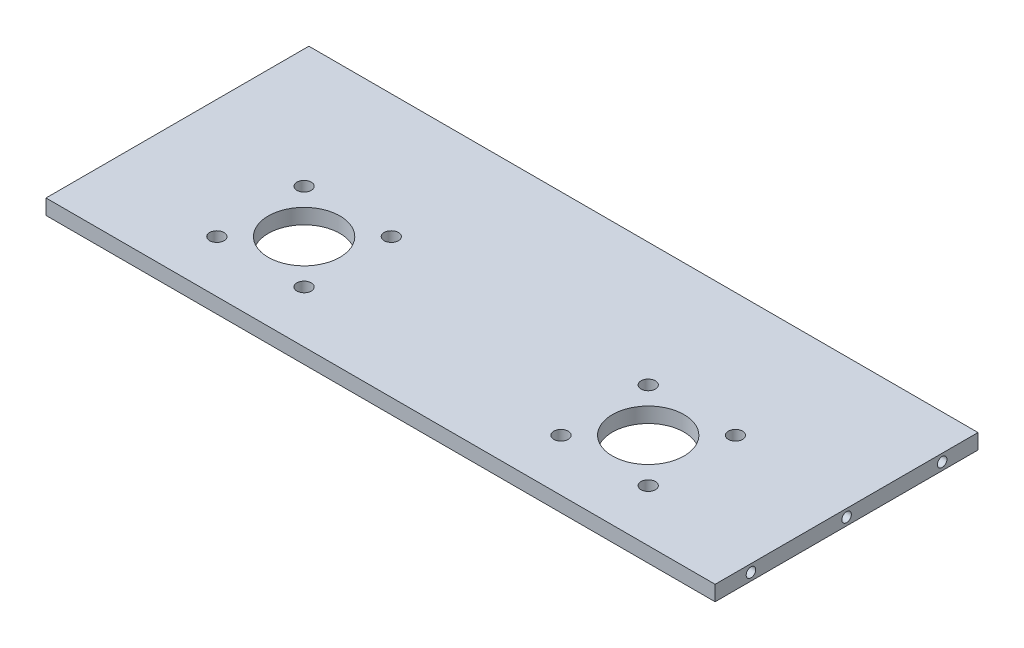
ISO-10303-21;
HEADER;
FILE_DESCRIPTION(('STEP AP214'),'2;1');
FILE_NAME('part.step','',(''),(''),'','','');
FILE_SCHEMA(('AUTOMOTIVE_DESIGN { 1 0 10303 214 1 1 1 1 }'));
ENDSEC;
DATA;
#1=APPLICATION_CONTEXT('core data for automotive mechanical design processes');
#2=APPLICATION_PROTOCOL_DEFINITION('international standard','automotive_design',2000,#1);
#3=PRODUCT_CONTEXT('',#1,'mechanical');
#4=PRODUCT('Part','Part','',(#3));
#5=PRODUCT_RELATED_PRODUCT_CATEGORY('part','',(#4));
#6=PRODUCT_DEFINITION_FORMATION('','',#4);
#7=PRODUCT_DEFINITION_CONTEXT('part definition',#1,'design');
#8=PRODUCT_DEFINITION('design','',#6,#7);
#9=PRODUCT_DEFINITION_SHAPE('','',#8);
#10=(LENGTH_UNIT() NAMED_UNIT(*) SI_UNIT(.MILLI.,.METRE.));
#11=(NAMED_UNIT(*) PLANE_ANGLE_UNIT() SI_UNIT($,.RADIAN.));
#12=(NAMED_UNIT(*) SI_UNIT($,.STERADIAN.) SOLID_ANGLE_UNIT());
#13=UNCERTAINTY_MEASURE_WITH_UNIT(LENGTH_MEASURE(1.E-05),#10,'distance_accuracy_value','');
#14=(GEOMETRIC_REPRESENTATION_CONTEXT(3) GLOBAL_UNCERTAINTY_ASSIGNED_CONTEXT((#13)) GLOBAL_UNIT_ASSIGNED_CONTEXT((#10,
#11,#12)) REPRESENTATION_CONTEXT('',''));
#15=CARTESIAN_POINT('',(0.,0.,0.));
#16=DIRECTION('',(0.,0.,1.));
#17=DIRECTION('',(1.,0.,0.));
#18=AXIS2_PLACEMENT_3D('',#15,#16,#17);
#19=CARTESIAN_POINT('',(0.,6.35,0.));
#20=DIRECTION('',(0.,1.,0.));
#21=DIRECTION('',(0.,0.,1.));
#22=AXIS2_PLACEMENT_3D('',#19,#20,#21);
#23=PLANE('',#22);
#24=CARTESIAN_POINT('',(104.544294294294,6.35,31.4932432432432));
#25=DIRECTION('',(0.,1.,0.));
#26=DIRECTION('',(0.,0.,1.));
#27=AXIS2_PLACEMENT_3D('',#24,#25,#26);
#28=CIRCLE('',#27,3.00000000000001);
#29=CARTESIAN_POINT('',(104.544294294294,6.35,34.4932432432432));
#30=VERTEX_POINT('',#29);
#31=EDGE_CURVE('E159',#30,#30,#28,.F.);
#32=ORIENTED_EDGE('',*,*,#31,.T.);
#33=EDGE_LOOP('',(#32));
#34=FACE_BOUND('',#33,.T.);
#35=CARTESIAN_POINT('',(104.544294294294,6.35,-5.00675675675668));
#36=DIRECTION('',(0.,1.,0.));
#37=DIRECTION('',(0.,0.,1.));
#38=AXIS2_PLACEMENT_3D('',#35,#36,#37);
#39=CIRCLE('',#38,3.00000000000001);
#40=CARTESIAN_POINT('',(104.544294294294,6.35,-2.00675675675668));
#41=VERTEX_POINT('',#40);
#42=EDGE_CURVE('E147',#41,#41,#39,.F.);
#43=ORIENTED_EDGE('',*,*,#42,.T.);
#44=EDGE_LOOP('',(#43));
#45=FACE_BOUND('',#44,.T.);
#46=CARTESIAN_POINT('',(-39.4557057057057,6.35,31.4932432432433));
#47=DIRECTION('',(0.,1.,0.));
#48=DIRECTION('',(0.,0.,1.));
#49=AXIS2_PLACEMENT_3D('',#46,#47,#48);
#50=CIRCLE('',#49,3.00000000000001);
#51=CARTESIAN_POINT('',(-39.4557057057057,6.35,34.4932432432433));
#52=VERTEX_POINT('',#51);
#53=EDGE_CURVE('E135',#52,#52,#50,.F.);
#54=ORIENTED_EDGE('',*,*,#53,.T.);
#55=EDGE_LOOP('',(#54));
#56=FACE_BOUND('',#55,.T.);
#57=CARTESIAN_POINT('',(86.2942942942943,6.35,13.2432432432432));
#58=DIRECTION('',(0.,1.,0.));
#59=DIRECTION('',(0.,0.,1.));
#60=AXIS2_PLACEMENT_3D('',#57,#58,#59);
#61=CIRCLE('',#60,15.);
#62=CARTESIAN_POINT('',(86.2942942942943,6.35,28.2432432432432));
#63=VERTEX_POINT('',#62);
#64=EDGE_CURVE('E123',#63,#63,#61,.F.);
#65=ORIENTED_EDGE('',*,*,#64,.T.);
#66=EDGE_LOOP('',(#65));
#67=FACE_BOUND('',#66,.T.);
#68=CARTESIAN_POINT('',(-39.4557057057057,6.35,-5.00675675675672));
#69=DIRECTION('',(0.,1.,0.));
#70=DIRECTION('',(0.,0.,1.));
#71=AXIS2_PLACEMENT_3D('',#68,#69,#70);
#72=CIRCLE('',#71,3.00000000000001);
#73=CARTESIAN_POINT('',(-39.4557057057057,6.35,-2.00675675675671));
#74=VERTEX_POINT('',#73);
#75=EDGE_CURVE('E100',#74,#74,#72,.F.);
#76=ORIENTED_EDGE('',*,*,#75,.T.);
#77=EDGE_LOOP('',(#76));
#78=FACE_BOUND('',#77,.T.);
#79=DIRECTION('',(0.,0.,1.));
#80=VECTOR('',#79,1.);
#81=CARTESIAN_POINT('',(-125.705705705706,6.35,-56.7567567567568));
#82=LINE('',#81,#80);
#83=CARTESIAN_POINT('',(-125.705705705706,6.35,-56.7567567567568));
#84=VERTEX_POINT('',#83);
#85=CARTESIAN_POINT('',(-125.705705705706,6.35,53.2432432432432));
#86=VERTEX_POINT('',#85);
#87=EDGE_CURVE('E85',#84,#86,#82,.T.);
#88=ORIENTED_EDGE('',*,*,#87,.T.);
#89=DIRECTION('',(1.,0.,0.));
#90=VECTOR('',#89,1.);
#91=CARTESIAN_POINT('',(-125.705705705706,6.35,53.2432432432432));
#92=LINE('',#91,#90);
#93=CARTESIAN_POINT('',(154.294294294294,6.35,53.2432432432432));
#94=VERTEX_POINT('',#93);
#95=EDGE_CURVE('E80',#86,#94,#92,.T.);
#96=ORIENTED_EDGE('',*,*,#95,.T.);
#97=DIRECTION('',(0.,0.,-1.));
#98=VECTOR('',#97,1.);
#99=CARTESIAN_POINT('',(154.294294294294,6.35,-56.7567567567568));
#100=LINE('',#99,#98);
#101=CARTESIAN_POINT('',(154.294294294294,6.35,-56.7567567567568));
#102=VERTEX_POINT('',#101);
#103=EDGE_CURVE('E83',#94,#102,#100,.T.);
#104=ORIENTED_EDGE('',*,*,#103,.T.);
#105=DIRECTION('',(-1.,0.,0.));
#106=VECTOR('',#105,1.);
#107=CARTESIAN_POINT('',(-125.705705705706,6.35,-56.7567567567568));
#108=LINE('',#107,#106);
#109=EDGE_CURVE('E50',#102,#84,#108,.T.);
#110=ORIENTED_EDGE('',*,*,#109,.T.);
#111=EDGE_LOOP('',(#88,#96,#104,#110));
#112=FACE_BOUND('',#111,.T.);
#113=CARTESIAN_POINT('',(-75.9557057057057,6.35,-5.00675675675672));
#114=DIRECTION('',(0.,1.,0.));
#115=DIRECTION('',(0.,0.,1.));
#116=AXIS2_PLACEMENT_3D('',#113,#114,#115);
#117=CIRCLE('',#116,3.00000000000001);
#118=CARTESIAN_POINT('',(-75.9557057057057,6.35,-2.00675675675671));
#119=VERTEX_POINT('',#118);
#120=EDGE_CURVE('E117',#119,#119,#117,.F.);
#121=ORIENTED_EDGE('',*,*,#120,.T.);
#122=EDGE_LOOP('',(#121));
#123=FACE_BOUND('',#122,.T.);
#124=CARTESIAN_POINT('',(-57.7057057057057,6.35,13.2432432432433));
#125=DIRECTION('',(0.,1.,0.));
#126=DIRECTION('',(0.,0.,1.));
#127=AXIS2_PLACEMENT_3D('',#124,#125,#126);
#128=CIRCLE('',#127,15.);
#129=CARTESIAN_POINT('',(-57.7057057057057,6.35,28.2432432432432));
#130=VERTEX_POINT('',#129);
#131=EDGE_CURVE('E129',#130,#130,#128,.F.);
#132=ORIENTED_EDGE('',*,*,#131,.T.);
#133=EDGE_LOOP('',(#132));
#134=FACE_BOUND('',#133,.T.);
#135=CARTESIAN_POINT('',(-75.9557057057057,6.35,31.4932432432433));
#136=DIRECTION('',(0.,1.,0.));
#137=DIRECTION('',(0.,0.,1.));
#138=AXIS2_PLACEMENT_3D('',#135,#136,#137);
#139=CIRCLE('',#138,3.00000000000001);
#140=CARTESIAN_POINT('',(-75.9557057057057,6.35,34.4932432432433));
#141=VERTEX_POINT('',#140);
#142=EDGE_CURVE('E141',#141,#141,#139,.F.);
#143=ORIENTED_EDGE('',*,*,#142,.T.);
#144=EDGE_LOOP('',(#143));
#145=FACE_BOUND('',#144,.T.);
#146=CARTESIAN_POINT('',(68.0442942942943,6.35,-5.00675675675668));
#147=DIRECTION('',(0.,1.,0.));
#148=DIRECTION('',(0.,0.,1.));
#149=AXIS2_PLACEMENT_3D('',#146,#147,#148);
#150=CIRCLE('',#149,3.00000000000001);
#151=CARTESIAN_POINT('',(68.0442942942943,6.35,-2.00675675675668));
#152=VERTEX_POINT('',#151);
#153=EDGE_CURVE('E153',#152,#152,#150,.F.);
#154=ORIENTED_EDGE('',*,*,#153,.T.);
#155=EDGE_LOOP('',(#154));
#156=FACE_BOUND('',#155,.T.);
#157=CARTESIAN_POINT('',(68.0442942942943,6.35,31.4932432432432));
#158=DIRECTION('',(0.,1.,0.));
#159=DIRECTION('',(0.,0.,1.));
#160=AXIS2_PLACEMENT_3D('',#157,#158,#159);
#161=CIRCLE('',#160,3.00000000000001);
#162=CARTESIAN_POINT('',(68.0442942942943,6.35,34.4932432432432));
#163=VERTEX_POINT('',#162);
#164=EDGE_CURVE('E165',#163,#163,#161,.F.);
#165=ORIENTED_EDGE('',*,*,#164,.T.);
#166=EDGE_LOOP('',(#165));
#167=FACE_BOUND('',#166,.T.);
#168=ADVANCED_FACE('F33',(#34,#45,#56,#67,#78,#112,#123,#134,#145,#156,#167),#23,.T.);
#169=CARTESIAN_POINT('',(0.,0.,0.));
#170=DIRECTION('',(0.,1.,0.));
#171=DIRECTION('',(0.,0.,1.));
#172=AXIS2_PLACEMENT_3D('',#169,#170,#171);
#173=PLANE('',#172);
#174=CARTESIAN_POINT('',(104.544294294294,0.,31.4932432432432));
#175=DIRECTION('',(0.,1.,0.));
#176=DIRECTION('',(0.,0.,1.));
#177=AXIS2_PLACEMENT_3D('',#174,#175,#176);
#178=CIRCLE('',#177,3.00000000000001);
#179=CARTESIAN_POINT('',(104.544294294294,0.,34.4932432432432));
#180=VERTEX_POINT('',#179);
#181=EDGE_CURVE('E162',#180,#180,#178,.T.);
#182=ORIENTED_EDGE('',*,*,#181,.T.);
#183=EDGE_LOOP('',(#182));
#184=FACE_BOUND('',#183,.T.);
#185=CARTESIAN_POINT('',(104.544294294294,0.,-5.00675675675668));
#186=DIRECTION('',(0.,1.,0.));
#187=DIRECTION('',(0.,0.,1.));
#188=AXIS2_PLACEMENT_3D('',#185,#186,#187);
#189=CIRCLE('',#188,3.00000000000001);
#190=CARTESIAN_POINT('',(104.544294294294,0.,-2.00675675675668));
#191=VERTEX_POINT('',#190);
#192=EDGE_CURVE('E150',#191,#191,#189,.T.);
#193=ORIENTED_EDGE('',*,*,#192,.T.);
#194=EDGE_LOOP('',(#193));
#195=FACE_BOUND('',#194,.T.);
#196=CARTESIAN_POINT('',(-39.4557057057057,0.,31.4932432432433));
#197=DIRECTION('',(0.,1.,0.));
#198=DIRECTION('',(0.,0.,1.));
#199=AXIS2_PLACEMENT_3D('',#196,#197,#198);
#200=CIRCLE('',#199,3.00000000000001);
#201=CARTESIAN_POINT('',(-39.4557057057057,0.,34.4932432432433));
#202=VERTEX_POINT('',#201);
#203=EDGE_CURVE('E138',#202,#202,#200,.T.);
#204=ORIENTED_EDGE('',*,*,#203,.T.);
#205=EDGE_LOOP('',(#204));
#206=FACE_BOUND('',#205,.T.);
#207=CARTESIAN_POINT('',(86.2942942942943,0.,13.2432432432432));
#208=DIRECTION('',(0.,1.,0.));
#209=DIRECTION('',(0.,0.,1.));
#210=AXIS2_PLACEMENT_3D('',#207,#208,#209);
#211=CIRCLE('',#210,15.);
#212=CARTESIAN_POINT('',(86.2942942942943,0.,28.2432432432432));
#213=VERTEX_POINT('',#212);
#214=EDGE_CURVE('E126',#213,#213,#211,.T.);
#215=ORIENTED_EDGE('',*,*,#214,.T.);
#216=EDGE_LOOP('',(#215));
#217=FACE_BOUND('',#216,.T.);
#218=CARTESIAN_POINT('',(-39.4557057057057,0.,-5.00675675675672));
#219=DIRECTION('',(0.,1.,0.));
#220=DIRECTION('',(0.,0.,1.));
#221=AXIS2_PLACEMENT_3D('',#218,#219,#220);
#222=CIRCLE('',#221,3.00000000000001);
#223=CARTESIAN_POINT('',(-39.4557057057057,0.,-2.00675675675671));
#224=VERTEX_POINT('',#223);
#225=EDGE_CURVE('E114',#224,#224,#222,.T.);
#226=ORIENTED_EDGE('',*,*,#225,.T.);
#227=EDGE_LOOP('',(#226));
#228=FACE_BOUND('',#227,.T.);
#229=DIRECTION('',(0.,0.,1.));
#230=VECTOR('',#229,1.);
#231=CARTESIAN_POINT('',(-125.705705705706,0.,-56.7567567567568));
#232=LINE('',#231,#230);
#233=CARTESIAN_POINT('',(-125.705705705706,0.,-56.7567567567568));
#234=VERTEX_POINT('',#233);
#235=CARTESIAN_POINT('',(-125.705705705706,0.,53.2432432432432));
#236=VERTEX_POINT('',#235);
#237=EDGE_CURVE('E97',#234,#236,#232,.T.);
#238=ORIENTED_EDGE('',*,*,#237,.F.);
#239=DIRECTION('',(-1.,0.,0.));
#240=VECTOR('',#239,1.);
#241=CARTESIAN_POINT('',(-125.705705705706,0.,-56.7567567567568));
#242=LINE('',#241,#240);
#243=CARTESIAN_POINT('',(154.294294294294,0.,-56.7567567567568));
#244=VERTEX_POINT('',#243);
#245=EDGE_CURVE('E73',#244,#234,#242,.T.);
#246=ORIENTED_EDGE('',*,*,#245,.F.);
#247=DIRECTION('',(0.,0.,-1.));
#248=VECTOR('',#247,1.);
#249=CARTESIAN_POINT('',(154.294294294294,0.,-56.7567567567568));
#250=LINE('',#249,#248);
#251=CARTESIAN_POINT('',(154.294294294294,0.,53.2432432432432));
#252=VERTEX_POINT('',#251);
#253=EDGE_CURVE('E67',#252,#244,#250,.T.);
#254=ORIENTED_EDGE('',*,*,#253,.F.);
#255=DIRECTION('',(1.,0.,0.));
#256=VECTOR('',#255,1.);
#257=CARTESIAN_POINT('',(-125.705705705706,0.,53.2432432432432));
#258=LINE('',#257,#256);
#259=EDGE_CURVE('E89',#236,#252,#258,.T.);
#260=ORIENTED_EDGE('',*,*,#259,.F.);
#261=EDGE_LOOP('',(#238,#246,#254,#260));
#262=FACE_BOUND('',#261,.T.);
#263=CARTESIAN_POINT('',(-75.9557057057057,0.,-5.00675675675672));
#264=DIRECTION('',(0.,1.,0.));
#265=DIRECTION('',(0.,0.,1.));
#266=AXIS2_PLACEMENT_3D('',#263,#264,#265);
#267=CIRCLE('',#266,3.00000000000001);
#268=CARTESIAN_POINT('',(-75.9557057057057,0.,-2.00675675675671));
#269=VERTEX_POINT('',#268);
#270=EDGE_CURVE('E120',#269,#269,#267,.T.);
#271=ORIENTED_EDGE('',*,*,#270,.T.);
#272=EDGE_LOOP('',(#271));
#273=FACE_BOUND('',#272,.T.);
#274=CARTESIAN_POINT('',(-57.7057057057057,0.,13.2432432432433));
#275=DIRECTION('',(0.,1.,0.));
#276=DIRECTION('',(0.,0.,1.));
#277=AXIS2_PLACEMENT_3D('',#274,#275,#276);
#278=CIRCLE('',#277,15.);
#279=CARTESIAN_POINT('',(-57.7057057057057,0.,28.2432432432432));
#280=VERTEX_POINT('',#279);
#281=EDGE_CURVE('E132',#280,#280,#278,.T.);
#282=ORIENTED_EDGE('',*,*,#281,.T.);
#283=EDGE_LOOP('',(#282));
#284=FACE_BOUND('',#283,.T.);
#285=CARTESIAN_POINT('',(-75.9557057057057,0.,31.4932432432433));
#286=DIRECTION('',(0.,1.,0.));
#287=DIRECTION('',(0.,0.,1.));
#288=AXIS2_PLACEMENT_3D('',#285,#286,#287);
#289=CIRCLE('',#288,3.00000000000001);
#290=CARTESIAN_POINT('',(-75.9557057057057,0.,34.4932432432433));
#291=VERTEX_POINT('',#290);
#292=EDGE_CURVE('E144',#291,#291,#289,.T.);
#293=ORIENTED_EDGE('',*,*,#292,.T.);
#294=EDGE_LOOP('',(#293));
#295=FACE_BOUND('',#294,.T.);
#296=CARTESIAN_POINT('',(68.0442942942943,0.,-5.00675675675668));
#297=DIRECTION('',(0.,1.,0.));
#298=DIRECTION('',(0.,0.,1.));
#299=AXIS2_PLACEMENT_3D('',#296,#297,#298);
#300=CIRCLE('',#299,3.00000000000001);
#301=CARTESIAN_POINT('',(68.0442942942943,0.,-2.00675675675668));
#302=VERTEX_POINT('',#301);
#303=EDGE_CURVE('E156',#302,#302,#300,.T.);
#304=ORIENTED_EDGE('',*,*,#303,.T.);
#305=EDGE_LOOP('',(#304));
#306=FACE_BOUND('',#305,.T.);
#307=CARTESIAN_POINT('',(68.0442942942943,0.,31.4932432432432));
#308=DIRECTION('',(0.,1.,0.));
#309=DIRECTION('',(0.,0.,1.));
#310=AXIS2_PLACEMENT_3D('',#307,#308,#309);
#311=CIRCLE('',#310,3.00000000000001);
#312=CARTESIAN_POINT('',(68.0442942942943,0.,34.4932432432432));
#313=VERTEX_POINT('',#312);
#314=EDGE_CURVE('E168',#313,#313,#311,.T.);
#315=ORIENTED_EDGE('',*,*,#314,.T.);
#316=EDGE_LOOP('',(#315));
#317=FACE_BOUND('',#316,.T.);
#318=ADVANCED_FACE('F108',(#184,#195,#206,#217,#228,#262,#273,#284,#295,#306,#317),#173,.F.);
#319=CARTESIAN_POINT('',(-125.705705705706,6.35,-56.7567567567568));
#320=DIRECTION('',(1.,0.,0.));
#321=DIRECTION('',(0.,0.,-1.));
#322=AXIS2_PLACEMENT_3D('',#319,#320,#321);
#323=PLANE('',#322);
#324=CARTESIAN_POINT('',(-125.705705705706,3.175,-1.75675675675677));
#325=DIRECTION('',(-1.,0.,0.));
#326=DIRECTION('',(0.,0.,1.));
#327=AXIS2_PLACEMENT_3D('',#324,#325,#326);
#328=CIRCLE('',#327,2.);
#329=CARTESIAN_POINT('',(-125.705705705706,3.175,0.24324324324323));
#330=VERTEX_POINT('',#329);
#331=EDGE_CURVE('E184',#330,#330,#328,.T.);
#332=ORIENTED_EDGE('',*,*,#331,.F.);
#333=EDGE_LOOP('',(#332));
#334=FACE_BOUND('',#333,.T.);
#335=CARTESIAN_POINT('',(-125.705705705706,3.175,-41.7567567567568));
#336=DIRECTION('',(-1.,0.,0.));
#337=DIRECTION('',(0.,0.,1.));
#338=AXIS2_PLACEMENT_3D('',#335,#336,#337);
#339=CIRCLE('',#338,2.);
#340=CARTESIAN_POINT('',(-125.705705705706,3.175,-39.7567567567568));
#341=VERTEX_POINT('',#340);
#342=EDGE_CURVE('E178',#341,#341,#339,.T.);
#343=ORIENTED_EDGE('',*,*,#342,.F.);
#344=EDGE_LOOP('',(#343));
#345=FACE_BOUND('',#344,.T.);
#346=CARTESIAN_POINT('',(-125.705705705706,3.175,38.2432432432432));
#347=DIRECTION('',(-1.,0.,0.));
#348=DIRECTION('',(0.,0.,1.));
#349=AXIS2_PLACEMENT_3D('',#346,#347,#348);
#350=CIRCLE('',#349,2.);
#351=CARTESIAN_POINT('',(-125.705705705706,3.175,40.2432432432432));
#352=VERTEX_POINT('',#351);
#353=EDGE_CURVE('E172',#352,#352,#350,.T.);
#354=ORIENTED_EDGE('',*,*,#353,.F.);
#355=EDGE_LOOP('',(#354));
#356=FACE_BOUND('',#355,.T.);
#357=ORIENTED_EDGE('',*,*,#237,.T.);
#358=DIRECTION('',(0.,-1.,0.));
#359=VECTOR('',#358,1.);
#360=CARTESIAN_POINT('',(-125.705705705706,6.35,53.2432432432432));
#361=LINE('',#360,#359);
#362=EDGE_CURVE('E11',#86,#236,#361,.T.);
#363=ORIENTED_EDGE('',*,*,#362,.F.);
#364=ORIENTED_EDGE('',*,*,#87,.F.);
#365=DIRECTION('',(0.,-1.,0.));
#366=VECTOR('',#365,1.);
#367=CARTESIAN_POINT('',(-125.705705705706,6.35,-56.7567567567568));
#368=LINE('',#367,#366);
#369=EDGE_CURVE('E93',#84,#234,#368,.T.);
#370=ORIENTED_EDGE('',*,*,#369,.T.);
#371=EDGE_LOOP('',(#357,#363,#364,#370));
#372=FACE_BOUND('',#371,.T.);
#373=ADVANCED_FACE('F35',(#334,#345,#356,#372),#323,.F.);
#374=CARTESIAN_POINT('',(-125.705705705706,6.35,53.2432432432432));
#375=DIRECTION('',(0.,0.,-1.));
#376=DIRECTION('',(-1.,0.,0.));
#377=AXIS2_PLACEMENT_3D('',#374,#375,#376);
#378=PLANE('',#377);
#379=ORIENTED_EDGE('',*,*,#259,.T.);
#380=DIRECTION('',(0.,-1.,0.));
#381=VECTOR('',#380,1.);
#382=CARTESIAN_POINT('',(154.294294294294,6.35,53.2432432432432));
#383=LINE('',#382,#381);
#384=EDGE_CURVE('E42',#94,#252,#383,.T.);
#385=ORIENTED_EDGE('',*,*,#384,.F.);
#386=ORIENTED_EDGE('',*,*,#95,.F.);
#387=ORIENTED_EDGE('',*,*,#362,.T.);
#388=EDGE_LOOP('',(#379,#385,#386,#387));
#389=FACE_BOUND('',#388,.T.);
#390=ADVANCED_FACE('F88',(#389),#378,.F.);
#391=CARTESIAN_POINT('',(154.294294294294,6.35,-56.7567567567568));
#392=DIRECTION('',(-1.,0.,0.));
#393=DIRECTION('',(0.,0.,1.));
#394=AXIS2_PLACEMENT_3D('',#391,#392,#393);
#395=PLANE('',#394);
#396=CARTESIAN_POINT('',(154.294294294294,3.175,-1.75675675675676));
#397=DIRECTION('',(1.,0.,0.));
#398=DIRECTION('',(0.,0.,-1.));
#399=AXIS2_PLACEMENT_3D('',#396,#397,#398);
#400=CIRCLE('',#399,2.);
#401=CARTESIAN_POINT('',(154.294294294294,3.175,-3.75675675675676));
#402=VERTEX_POINT('',#401);
#403=EDGE_CURVE('E202',#402,#402,#400,.T.);
#404=ORIENTED_EDGE('',*,*,#403,.F.);
#405=EDGE_LOOP('',(#404));
#406=FACE_BOUND('',#405,.T.);
#407=CARTESIAN_POINT('',(154.294294294294,3.175,38.2432432432432));
#408=DIRECTION('',(1.,0.,0.));
#409=DIRECTION('',(0.,0.,-1.));
#410=AXIS2_PLACEMENT_3D('',#407,#408,#409);
#411=CIRCLE('',#410,2.);
#412=CARTESIAN_POINT('',(154.294294294294,3.175,36.2432432432432));
#413=VERTEX_POINT('',#412);
#414=EDGE_CURVE('E196',#413,#413,#411,.T.);
#415=ORIENTED_EDGE('',*,*,#414,.F.);
#416=EDGE_LOOP('',(#415));
#417=FACE_BOUND('',#416,.T.);
#418=CARTESIAN_POINT('',(154.294294294294,3.175,-41.7567567567568));
#419=DIRECTION('',(1.,0.,0.));
#420=DIRECTION('',(0.,0.,-1.));
#421=AXIS2_PLACEMENT_3D('',#418,#419,#420);
#422=CIRCLE('',#421,2.);
#423=CARTESIAN_POINT('',(154.294294294294,3.175,-43.7567567567568));
#424=VERTEX_POINT('',#423);
#425=EDGE_CURVE('E190',#424,#424,#422,.T.);
#426=ORIENTED_EDGE('',*,*,#425,.F.);
#427=EDGE_LOOP('',(#426));
#428=FACE_BOUND('',#427,.T.);
#429=ORIENTED_EDGE('',*,*,#253,.T.);
#430=DIRECTION('',(0.,-1.,0.));
#431=VECTOR('',#430,1.);
#432=CARTESIAN_POINT('',(154.294294294294,6.35,-56.7567567567568));
#433=LINE('',#432,#431);
#434=EDGE_CURVE('E90',#102,#244,#433,.T.);
#435=ORIENTED_EDGE('',*,*,#434,.F.);
#436=ORIENTED_EDGE('',*,*,#103,.F.);
#437=ORIENTED_EDGE('',*,*,#384,.T.);
#438=EDGE_LOOP('',(#429,#435,#436,#437));
#439=FACE_BOUND('',#438,.T.);
#440=ADVANCED_FACE('F91',(#406,#417,#428,#439),#395,.F.);
#441=CARTESIAN_POINT('',(-125.705705705706,6.35,-56.7567567567568));
#442=DIRECTION('',(0.,0.,1.));
#443=DIRECTION('',(1.,0.,0.));
#444=AXIS2_PLACEMENT_3D('',#441,#442,#443);
#445=PLANE('',#444);
#446=ORIENTED_EDGE('',*,*,#245,.T.);
#447=ORIENTED_EDGE('',*,*,#369,.F.);
#448=ORIENTED_EDGE('',*,*,#109,.F.);
#449=ORIENTED_EDGE('',*,*,#434,.T.);
#450=EDGE_LOOP('',(#446,#447,#448,#449));
#451=FACE_BOUND('',#450,.T.);
#452=ADVANCED_FACE('F105',(#451),#445,.F.);
#453=CARTESIAN_POINT('',(-39.4557057057057,20.,-5.00675675675672));
#454=DIRECTION('',(0.,-1.,0.));
#455=DIRECTION('',(0.,0.,-1.));
#456=AXIS2_PLACEMENT_3D('',#453,#454,#455);
#457=CYLINDRICAL_SURFACE('',#456,3.00000000000001);
#458=ORIENTED_EDGE('',*,*,#75,.F.);
#459=EDGE_LOOP('',(#458));
#460=FACE_BOUND('',#459,.T.);
#461=ORIENTED_EDGE('',*,*,#225,.F.);
#462=EDGE_LOOP('',(#461));
#463=FACE_BOUND('',#462,.T.);
#464=ADVANCED_FACE('F251',(#460,#463),#457,.F.);
#465=CARTESIAN_POINT('',(-75.9557057057057,20.,-5.00675675675672));
#466=DIRECTION('',(0.,-1.,0.));
#467=DIRECTION('',(0.,0.,-1.));
#468=AXIS2_PLACEMENT_3D('',#465,#466,#467);
#469=CYLINDRICAL_SURFACE('',#468,3.00000000000001);
#470=ORIENTED_EDGE('',*,*,#120,.F.);
#471=EDGE_LOOP('',(#470));
#472=FACE_BOUND('',#471,.T.);
#473=ORIENTED_EDGE('',*,*,#270,.F.);
#474=EDGE_LOOP('',(#473));
#475=FACE_BOUND('',#474,.T.);
#476=ADVANCED_FACE('F312',(#472,#475),#469,.F.);
#477=CARTESIAN_POINT('',(86.2942942942943,20.,13.2432432432432));
#478=DIRECTION('',(0.,-1.,0.));
#479=DIRECTION('',(0.,0.,-1.));
#480=AXIS2_PLACEMENT_3D('',#477,#478,#479);
#481=CYLINDRICAL_SURFACE('',#480,15.);
#482=ORIENTED_EDGE('',*,*,#64,.F.);
#483=EDGE_LOOP('',(#482));
#484=FACE_BOUND('',#483,.T.);
#485=ORIENTED_EDGE('',*,*,#214,.F.);
#486=EDGE_LOOP('',(#485));
#487=FACE_BOUND('',#486,.T.);
#488=ADVANCED_FACE('F309',(#484,#487),#481,.F.);
#489=CARTESIAN_POINT('',(-57.7057057057057,20.,13.2432432432433));
#490=DIRECTION('',(0.,-1.,0.));
#491=DIRECTION('',(0.,0.,-1.));
#492=AXIS2_PLACEMENT_3D('',#489,#490,#491);
#493=CYLINDRICAL_SURFACE('',#492,15.);
#494=ORIENTED_EDGE('',*,*,#131,.F.);
#495=EDGE_LOOP('',(#494));
#496=FACE_BOUND('',#495,.T.);
#497=ORIENTED_EDGE('',*,*,#281,.F.);
#498=EDGE_LOOP('',(#497));
#499=FACE_BOUND('',#498,.T.);
#500=ADVANCED_FACE('F305',(#496,#499),#493,.F.);
#501=CARTESIAN_POINT('',(-39.4557057057057,20.,31.4932432432433));
#502=DIRECTION('',(0.,-1.,0.));
#503=DIRECTION('',(0.,0.,-1.));
#504=AXIS2_PLACEMENT_3D('',#501,#502,#503);
#505=CYLINDRICAL_SURFACE('',#504,3.00000000000001);
#506=ORIENTED_EDGE('',*,*,#53,.F.);
#507=EDGE_LOOP('',(#506));
#508=FACE_BOUND('',#507,.T.);
#509=ORIENTED_EDGE('',*,*,#203,.F.);
#510=EDGE_LOOP('',(#509));
#511=FACE_BOUND('',#510,.T.);
#512=ADVANCED_FACE('F301',(#508,#511),#505,.F.);
#513=CARTESIAN_POINT('',(-75.9557057057057,20.,31.4932432432433));
#514=DIRECTION('',(0.,-1.,0.));
#515=DIRECTION('',(0.,0.,-1.));
#516=AXIS2_PLACEMENT_3D('',#513,#514,#515);
#517=CYLINDRICAL_SURFACE('',#516,3.00000000000001);
#518=ORIENTED_EDGE('',*,*,#142,.F.);
#519=EDGE_LOOP('',(#518));
#520=FACE_BOUND('',#519,.T.);
#521=ORIENTED_EDGE('',*,*,#292,.F.);
#522=EDGE_LOOP('',(#521));
#523=FACE_BOUND('',#522,.T.);
#524=ADVANCED_FACE('F297',(#520,#523),#517,.F.);
#525=CARTESIAN_POINT('',(104.544294294294,20.,-5.00675675675668));
#526=DIRECTION('',(0.,-1.,0.));
#527=DIRECTION('',(0.,0.,-1.));
#528=AXIS2_PLACEMENT_3D('',#525,#526,#527);
#529=CYLINDRICAL_SURFACE('',#528,3.00000000000001);
#530=ORIENTED_EDGE('',*,*,#42,.F.);
#531=EDGE_LOOP('',(#530));
#532=FACE_BOUND('',#531,.T.);
#533=ORIENTED_EDGE('',*,*,#192,.F.);
#534=EDGE_LOOP('',(#533));
#535=FACE_BOUND('',#534,.T.);
#536=ADVANCED_FACE('F293',(#532,#535),#529,.F.);
#537=CARTESIAN_POINT('',(68.0442942942943,20.,-5.00675675675668));
#538=DIRECTION('',(0.,-1.,0.));
#539=DIRECTION('',(0.,0.,-1.));
#540=AXIS2_PLACEMENT_3D('',#537,#538,#539);
#541=CYLINDRICAL_SURFACE('',#540,3.00000000000001);
#542=ORIENTED_EDGE('',*,*,#153,.F.);
#543=EDGE_LOOP('',(#542));
#544=FACE_BOUND('',#543,.T.);
#545=ORIENTED_EDGE('',*,*,#303,.F.);
#546=EDGE_LOOP('',(#545));
#547=FACE_BOUND('',#546,.T.);
#548=ADVANCED_FACE('F289',(#544,#547),#541,.F.);
#549=CARTESIAN_POINT('',(104.544294294294,20.,31.4932432432432));
#550=DIRECTION('',(0.,-1.,0.));
#551=DIRECTION('',(0.,0.,-1.));
#552=AXIS2_PLACEMENT_3D('',#549,#550,#551);
#553=CYLINDRICAL_SURFACE('',#552,3.00000000000001);
#554=ORIENTED_EDGE('',*,*,#31,.F.);
#555=EDGE_LOOP('',(#554));
#556=FACE_BOUND('',#555,.T.);
#557=ORIENTED_EDGE('',*,*,#181,.F.);
#558=EDGE_LOOP('',(#557));
#559=FACE_BOUND('',#558,.T.);
#560=ADVANCED_FACE('F281',(#556,#559),#553,.F.);
#561=CARTESIAN_POINT('',(68.0442942942943,20.,31.4932432432432));
#562=DIRECTION('',(0.,-1.,0.));
#563=DIRECTION('',(0.,0.,-1.));
#564=AXIS2_PLACEMENT_3D('',#561,#562,#563);
#565=CYLINDRICAL_SURFACE('',#564,3.00000000000001);
#566=ORIENTED_EDGE('',*,*,#164,.F.);
#567=EDGE_LOOP('',(#566));
#568=FACE_BOUND('',#567,.T.);
#569=ORIENTED_EDGE('',*,*,#314,.F.);
#570=EDGE_LOOP('',(#569));
#571=FACE_BOUND('',#570,.T.);
#572=ADVANCED_FACE('F271',(#568,#571),#565,.F.);
#573=CARTESIAN_POINT('',(-95.7057057057057,3.175,38.2432432432432));
#574=DIRECTION('',(-1.,0.,0.));
#575=DIRECTION('',(0.,0.,1.));
#576=AXIS2_PLACEMENT_3D('',#573,#574,#575);
#577=CYLINDRICAL_SURFACE('',#576,2.);
#578=CARTESIAN_POINT('',(-95.7057057057057,3.175,38.2432432432432));
#579=DIRECTION('',(-1.,0.,0.));
#580=DIRECTION('',(0.,0.,1.));
#581=AXIS2_PLACEMENT_3D('',#578,#579,#580);
#582=CIRCLE('',#581,2.);
#583=CARTESIAN_POINT('',(-95.7057057057057,3.175,40.2432432432432));
#584=VERTEX_POINT('',#583);
#585=EDGE_CURVE('E171',#584,#584,#582,.T.);
#586=ORIENTED_EDGE('',*,*,#585,.F.);
#587=EDGE_LOOP('',(#586));
#588=FACE_BOUND('',#587,.T.);
#589=ORIENTED_EDGE('',*,*,#353,.T.);
#590=EDGE_LOOP('',(#589));
#591=FACE_BOUND('',#590,.T.);
#592=ADVANCED_FACE('F268',(#588,#591),#577,.F.);
#593=CARTESIAN_POINT('',(-95.7057057057057,3.175,38.2432432432432));
#594=DIRECTION('',(-1.,0.,0.));
#595=DIRECTION('',(0.,0.,1.));
#596=AXIS2_PLACEMENT_3D('',#593,#594,#595);
#597=PLANE('',#596);
#598=ORIENTED_EDGE('',*,*,#585,.T.);
#599=EDGE_LOOP('',(#598));
#600=FACE_BOUND('',#599,.T.);
#601=ADVANCED_FACE('F270',(#600),#597,.T.);
#602=CARTESIAN_POINT('',(-95.7057057057057,3.175,-41.7567567567568));
#603=DIRECTION('',(-1.,0.,0.));
#604=DIRECTION('',(0.,0.,1.));
#605=AXIS2_PLACEMENT_3D('',#602,#603,#604);
#606=CYLINDRICAL_SURFACE('',#605,2.);
#607=CARTESIAN_POINT('',(-95.7057057057057,3.175,-41.7567567567568));
#608=DIRECTION('',(-1.,0.,0.));
#609=DIRECTION('',(0.,0.,1.));
#610=AXIS2_PLACEMENT_3D('',#607,#608,#609);
#611=CIRCLE('',#610,2.);
#612=CARTESIAN_POINT('',(-95.7057057057057,3.175,-39.7567567567568));
#613=VERTEX_POINT('',#612);
#614=EDGE_CURVE('E175',#613,#613,#611,.T.);
#615=ORIENTED_EDGE('',*,*,#614,.F.);
#616=EDGE_LOOP('',(#615));
#617=FACE_BOUND('',#616,.T.);
#618=ORIENTED_EDGE('',*,*,#342,.T.);
#619=EDGE_LOOP('',(#618));
#620=FACE_BOUND('',#619,.T.);
#621=ADVANCED_FACE('F278',(#617,#620),#606,.F.);
#622=CARTESIAN_POINT('',(-95.7057057057057,3.175,-41.7567567567568));
#623=DIRECTION('',(-1.,0.,0.));
#624=DIRECTION('',(0.,0.,1.));
#625=AXIS2_PLACEMENT_3D('',#622,#623,#624);
#626=PLANE('',#625);
#627=ORIENTED_EDGE('',*,*,#614,.T.);
#628=EDGE_LOOP('',(#627));
#629=FACE_BOUND('',#628,.T.);
#630=ADVANCED_FACE('F419',(#629),#626,.T.);
#631=CARTESIAN_POINT('',(-95.7057057057057,3.175,-1.75675675675678));
#632=DIRECTION('',(-1.,0.,0.));
#633=DIRECTION('',(0.,0.,1.));
#634=AXIS2_PLACEMENT_3D('',#631,#632,#633);
#635=CYLINDRICAL_SURFACE('',#634,2.);
#636=CARTESIAN_POINT('',(-95.7057057057057,3.175,-1.75675675675678));
#637=DIRECTION('',(-1.,0.,0.));
#638=DIRECTION('',(0.,0.,1.));
#639=AXIS2_PLACEMENT_3D('',#636,#637,#638);
#640=CIRCLE('',#639,2.);
#641=CARTESIAN_POINT('',(-95.7057057057057,3.175,0.243243243243223));
#642=VERTEX_POINT('',#641);
#643=EDGE_CURVE('E181',#642,#642,#640,.T.);
#644=ORIENTED_EDGE('',*,*,#643,.F.);
#645=EDGE_LOOP('',(#644));
#646=FACE_BOUND('',#645,.T.);
#647=ORIENTED_EDGE('',*,*,#331,.T.);
#648=EDGE_LOOP('',(#647));
#649=FACE_BOUND('',#648,.T.);
#650=ADVANCED_FACE('F237',(#646,#649),#635,.F.);
#651=CARTESIAN_POINT('',(-95.7057057057057,3.175,-1.75675675675678));
#652=DIRECTION('',(-1.,0.,0.));
#653=DIRECTION('',(0.,0.,1.));
#654=AXIS2_PLACEMENT_3D('',#651,#652,#653);
#655=PLANE('',#654);
#656=ORIENTED_EDGE('',*,*,#643,.T.);
#657=EDGE_LOOP('',(#656));
#658=FACE_BOUND('',#657,.T.);
#659=ADVANCED_FACE('F227',(#658),#655,.T.);
#660=CARTESIAN_POINT('',(124.294294294294,3.175,-41.7567567567568));
#661=DIRECTION('',(1.,0.,0.));
#662=DIRECTION('',(0.,0.,-1.));
#663=AXIS2_PLACEMENT_3D('',#660,#661,#662);
#664=CYLINDRICAL_SURFACE('',#663,2.);
#665=CARTESIAN_POINT('',(124.294294294294,3.175,-41.7567567567568));
#666=DIRECTION('',(1.,0.,0.));
#667=DIRECTION('',(0.,0.,-1.));
#668=AXIS2_PLACEMENT_3D('',#665,#666,#667);
#669=CIRCLE('',#668,2.);
#670=CARTESIAN_POINT('',(124.294294294294,3.175,-43.7567567567568));
#671=VERTEX_POINT('',#670);
#672=EDGE_CURVE('E187',#671,#671,#669,.T.);
#673=ORIENTED_EDGE('',*,*,#672,.F.);
#674=EDGE_LOOP('',(#673));
#675=FACE_BOUND('',#674,.T.);
#676=ORIENTED_EDGE('',*,*,#425,.T.);
#677=EDGE_LOOP('',(#676));
#678=FACE_BOUND('',#677,.T.);
#679=ADVANCED_FACE('F224',(#675,#678),#664,.F.);
#680=CARTESIAN_POINT('',(124.294294294294,3.175,-41.7567567567568));
#681=DIRECTION('',(1.,0.,0.));
#682=DIRECTION('',(0.,0.,-1.));
#683=AXIS2_PLACEMENT_3D('',#680,#681,#682);
#684=PLANE('',#683);
#685=ORIENTED_EDGE('',*,*,#672,.T.);
#686=EDGE_LOOP('',(#685));
#687=FACE_BOUND('',#686,.T.);
#688=ADVANCED_FACE('F226',(#687),#684,.T.);
#689=CARTESIAN_POINT('',(124.294294294294,3.175,38.2432432432432));
#690=DIRECTION('',(1.,0.,0.));
#691=DIRECTION('',(0.,0.,-1.));
#692=AXIS2_PLACEMENT_3D('',#689,#690,#691);
#693=CYLINDRICAL_SURFACE('',#692,2.);
#694=CARTESIAN_POINT('',(124.294294294294,3.175,38.2432432432432));
#695=DIRECTION('',(1.,0.,0.));
#696=DIRECTION('',(0.,0.,-1.));
#697=AXIS2_PLACEMENT_3D('',#694,#695,#696);
#698=CIRCLE('',#697,2.);
#699=CARTESIAN_POINT('',(124.294294294294,3.175,36.2432432432432));
#700=VERTEX_POINT('',#699);
#701=EDGE_CURVE('E193',#700,#700,#698,.T.);
#702=ORIENTED_EDGE('',*,*,#701,.F.);
#703=EDGE_LOOP('',(#702));
#704=FACE_BOUND('',#703,.T.);
#705=ORIENTED_EDGE('',*,*,#414,.T.);
#706=EDGE_LOOP('',(#705));
#707=FACE_BOUND('',#706,.T.);
#708=ADVANCED_FACE('F234',(#704,#707),#693,.F.);
#709=CARTESIAN_POINT('',(124.294294294294,3.175,38.2432432432432));
#710=DIRECTION('',(1.,0.,0.));
#711=DIRECTION('',(0.,0.,-1.));
#712=AXIS2_PLACEMENT_3D('',#709,#710,#711);
#713=PLANE('',#712);
#714=ORIENTED_EDGE('',*,*,#701,.T.);
#715=EDGE_LOOP('',(#714));
#716=FACE_BOUND('',#715,.T.);
#717=ADVANCED_FACE('F213',(#716),#713,.T.);
#718=CARTESIAN_POINT('',(124.294294294294,3.175,-1.75675675675676));
#719=DIRECTION('',(1.,0.,0.));
#720=DIRECTION('',(0.,0.,-1.));
#721=AXIS2_PLACEMENT_3D('',#718,#719,#720);
#722=CYLINDRICAL_SURFACE('',#721,2.);
#723=CARTESIAN_POINT('',(124.294294294294,3.175,-1.75675675675676));
#724=DIRECTION('',(1.,0.,0.));
#725=DIRECTION('',(0.,0.,-1.));
#726=AXIS2_PLACEMENT_3D('',#723,#724,#725);
#727=CIRCLE('',#726,2.);
#728=CARTESIAN_POINT('',(124.294294294294,3.175,-3.75675675675676));
#729=VERTEX_POINT('',#728);
#730=EDGE_CURVE('E199',#729,#729,#727,.T.);
#731=ORIENTED_EDGE('',*,*,#730,.F.);
#732=EDGE_LOOP('',(#731));
#733=FACE_BOUND('',#732,.T.);
#734=ORIENTED_EDGE('',*,*,#403,.T.);
#735=EDGE_LOOP('',(#734));
#736=FACE_BOUND('',#735,.T.);
#737=ADVANCED_FACE('F210',(#733,#736),#722,.F.);
#738=CARTESIAN_POINT('',(124.294294294294,3.175,-1.75675675675676));
#739=DIRECTION('',(1.,0.,0.));
#740=DIRECTION('',(0.,0.,-1.));
#741=AXIS2_PLACEMENT_3D('',#738,#739,#740);
#742=PLANE('',#741);
#743=ORIENTED_EDGE('',*,*,#730,.T.);
#744=EDGE_LOOP('',(#743));
#745=FACE_BOUND('',#744,.T.);
#746=ADVANCED_FACE('F208',(#745),#742,.T.);
#747=CLOSED_SHELL('',(#168,#318,#373,#390,#440,#452,#464,#476,#488,#500,#512,#524,#536,#548,
#560,#572,#592,#601,#621,#630,#650,#659,#679,#688,#708,#717,#737,#746));
#748=MANIFOLD_SOLID_BREP('B2',#747);
#749=ADVANCED_BREP_SHAPE_REPRESENTATION('',(#18,#748),#14);
#750=SHAPE_DEFINITION_REPRESENTATION(#9,#749);
ENDSEC;
END-ISO-10303-21;
